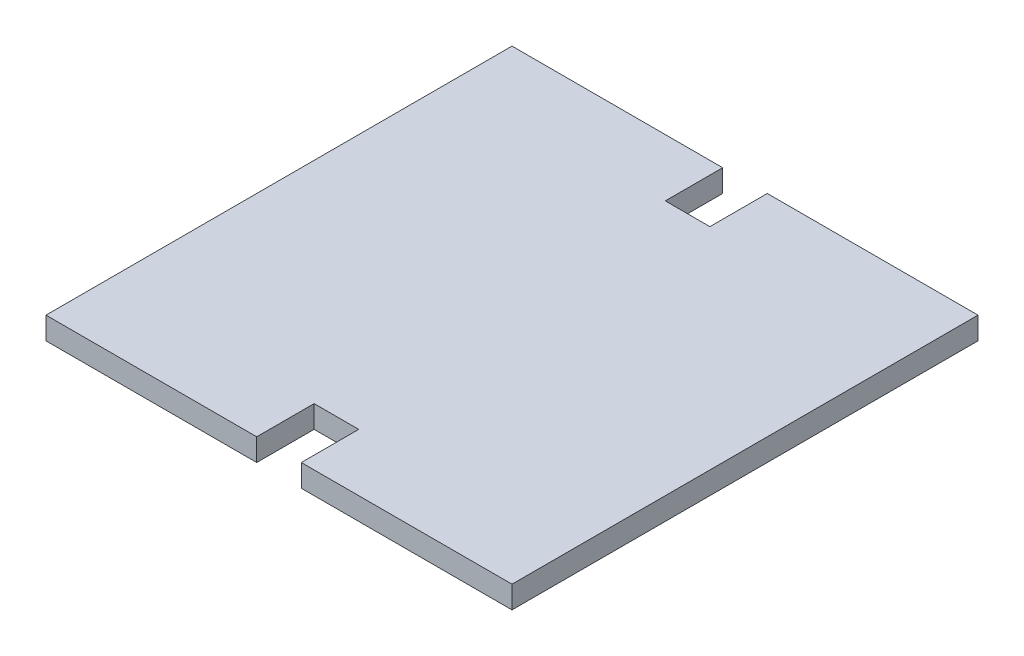
ISO-10303-21;
HEADER;
FILE_DESCRIPTION(('STEP AP214'),'2;1');
FILE_NAME('part.step','',(''),(''),'','','');
FILE_SCHEMA(('AUTOMOTIVE_DESIGN { 1 0 10303 214 1 1 1 1 }'));
ENDSEC;
DATA;
#1=APPLICATION_CONTEXT('core data for automotive mechanical design processes');
#2=APPLICATION_PROTOCOL_DEFINITION('international standard','automotive_design',2000,#1);
#3=PRODUCT_CONTEXT('',#1,'mechanical');
#4=PRODUCT('Part','Part','',(#3));
#5=PRODUCT_RELATED_PRODUCT_CATEGORY('part','',(#4));
#6=PRODUCT_DEFINITION_FORMATION('','',#4);
#7=PRODUCT_DEFINITION_CONTEXT('part definition',#1,'design');
#8=PRODUCT_DEFINITION('design','',#6,#7);
#9=PRODUCT_DEFINITION_SHAPE('','',#8);
#10=(LENGTH_UNIT() NAMED_UNIT(*) SI_UNIT(.MILLI.,.METRE.));
#11=(NAMED_UNIT(*) PLANE_ANGLE_UNIT() SI_UNIT($,.RADIAN.));
#12=(NAMED_UNIT(*) SI_UNIT($,.STERADIAN.) SOLID_ANGLE_UNIT());
#13=UNCERTAINTY_MEASURE_WITH_UNIT(LENGTH_MEASURE(1.E-05),#10,'distance_accuracy_value','');
#14=(GEOMETRIC_REPRESENTATION_CONTEXT(3) GLOBAL_UNCERTAINTY_ASSIGNED_CONTEXT((#13)) GLOBAL_UNIT_ASSIGNED_CONTEXT((#10,
#11,#12)) REPRESENTATION_CONTEXT('',''));
#15=CARTESIAN_POINT('',(0.,0.,0.));
#16=DIRECTION('',(0.,0.,1.));
#17=DIRECTION('',(1.,0.,0.));
#18=AXIS2_PLACEMENT_3D('',#15,#16,#17);
#19=CARTESIAN_POINT('',(-66.35,6.35,66.35));
#20=DIRECTION('',(0.,0.,-1.));
#21=DIRECTION('',(-1.,0.,0.));
#22=AXIS2_PLACEMENT_3D('',#19,#20,#21);
#23=PLANE('',#22);
#24=DIRECTION('',(1.,0.,0.));
#25=VECTOR('',#24,1.);
#26=CARTESIAN_POINT('',(-66.35,6.35,66.35));
#27=LINE('',#26,#25);
#28=CARTESIAN_POINT('',(6.35,6.35,66.35));
#29=VERTEX_POINT('',#28);
#30=CARTESIAN_POINT('',(66.35,6.35,66.35));
#31=VERTEX_POINT('',#30);
#32=EDGE_CURVE('E189',#29,#31,#27,.T.);
#33=ORIENTED_EDGE('',*,*,#32,.F.);
#34=DIRECTION('',(0.,1.,0.));
#35=VECTOR('',#34,1.);
#36=CARTESIAN_POINT('',(6.35,0.,66.35));
#37=LINE('',#36,#35);
#38=CARTESIAN_POINT('',(6.35,0.,66.35));
#39=VERTEX_POINT('',#38);
#40=EDGE_CURVE('E153',#39,#29,#37,.T.);
#41=ORIENTED_EDGE('',*,*,#40,.F.);
#42=DIRECTION('',(1.,0.,0.));
#43=VECTOR('',#42,1.);
#44=CARTESIAN_POINT('',(-66.35,0.,66.35));
#45=LINE('',#44,#43);
#46=CARTESIAN_POINT('',(66.35,0.,66.35));
#47=VERTEX_POINT('',#46);
#48=EDGE_CURVE('E202',#39,#47,#45,.T.);
#49=ORIENTED_EDGE('',*,*,#48,.T.);
#50=DIRECTION('',(0.,-1.,0.));
#51=VECTOR('',#50,1.);
#52=CARTESIAN_POINT('',(66.35,6.35,66.35));
#53=LINE('',#52,#51);
#54=EDGE_CURVE('E193',#31,#47,#53,.T.);
#55=ORIENTED_EDGE('',*,*,#54,.F.);
#56=EDGE_LOOP('',(#33,#41,#49,#55));
#57=FACE_BOUND('',#56,.T.);
#58=ADVANCED_FACE('F32',(#57),#23,.F.);
#59=CARTESIAN_POINT('',(-66.35,6.35,-66.35));
#60=DIRECTION('',(0.,0.,1.));
#61=DIRECTION('',(1.,0.,0.));
#62=AXIS2_PLACEMENT_3D('',#59,#60,#61);
#63=PLANE('',#62);
#64=DIRECTION('',(-1.,0.,0.));
#65=VECTOR('',#64,1.);
#66=CARTESIAN_POINT('',(-66.35,6.35,-66.35));
#67=LINE('',#66,#65);
#68=CARTESIAN_POINT('',(-6.35,6.35,-66.35));
#69=VERTEX_POINT('',#68);
#70=CARTESIAN_POINT('',(-66.35,6.35,-66.35));
#71=VERTEX_POINT('',#70);
#72=EDGE_CURVE('E182',#69,#71,#67,.T.);
#73=ORIENTED_EDGE('',*,*,#72,.F.);
#74=DIRECTION('',(0.,1.,0.));
#75=VECTOR('',#74,1.);
#76=CARTESIAN_POINT('',(-6.35,0.,-66.35));
#77=LINE('',#76,#75);
#78=CARTESIAN_POINT('',(-6.35,0.,-66.35));
#79=VERTEX_POINT('',#78);
#80=EDGE_CURVE('E175',#79,#69,#77,.T.);
#81=ORIENTED_EDGE('',*,*,#80,.F.);
#82=DIRECTION('',(-1.,0.,0.));
#83=VECTOR('',#82,1.);
#84=CARTESIAN_POINT('',(-66.35,0.,-66.35));
#85=LINE('',#84,#83);
#86=CARTESIAN_POINT('',(-66.35,0.,-66.35));
#87=VERTEX_POINT('',#86);
#88=EDGE_CURVE('E196',#79,#87,#85,.T.);
#89=ORIENTED_EDGE('',*,*,#88,.T.);
#90=DIRECTION('',(0.,-1.,0.));
#91=VECTOR('',#90,1.);
#92=CARTESIAN_POINT('',(-66.35,6.35,-66.35));
#93=LINE('',#92,#91);
#94=EDGE_CURVE('E40',#71,#87,#93,.T.);
#95=ORIENTED_EDGE('',*,*,#94,.F.);
#96=EDGE_LOOP('',(#73,#81,#89,#95));
#97=FACE_BOUND('',#96,.T.);
#98=ADVANCED_FACE('F226',(#97),#63,.F.);
#99=CARTESIAN_POINT('',(66.35,6.35,66.35));
#100=DIRECTION('',(-1.,0.,0.));
#101=DIRECTION('',(0.,0.,1.));
#102=AXIS2_PLACEMENT_3D('',#99,#100,#101);
#103=PLANE('',#102);
#104=DIRECTION('',(0.,0.,-1.));
#105=VECTOR('',#104,1.);
#106=CARTESIAN_POINT('',(66.35,0.,66.35));
#107=LINE('',#106,#105);
#108=CARTESIAN_POINT('',(66.35,0.,-66.35));
#109=VERTEX_POINT('',#108);
#110=EDGE_CURVE('E174',#47,#109,#107,.T.);
#111=ORIENTED_EDGE('',*,*,#110,.T.);
#112=DIRECTION('',(0.,-1.,0.));
#113=VECTOR('',#112,1.);
#114=CARTESIAN_POINT('',(66.35,6.35,-66.35));
#115=LINE('',#114,#113);
#116=CARTESIAN_POINT('',(66.35,6.35,-66.35));
#117=VERTEX_POINT('',#116);
#118=EDGE_CURVE('E11',#117,#109,#115,.T.);
#119=ORIENTED_EDGE('',*,*,#118,.F.);
#120=DIRECTION('',(0.,0.,-1.));
#121=VECTOR('',#120,1.);
#122=CARTESIAN_POINT('',(66.35,6.35,66.35));
#123=LINE('',#122,#121);
#124=EDGE_CURVE('E179',#31,#117,#123,.T.);
#125=ORIENTED_EDGE('',*,*,#124,.F.);
#126=ORIENTED_EDGE('',*,*,#54,.T.);
#127=EDGE_LOOP('',(#111,#119,#125,#126));
#128=FACE_BOUND('',#127,.T.);
#129=ADVANCED_FACE('F34',(#128),#103,.F.);
#130=CARTESIAN_POINT('',(6.35000000000001,0.,-66.35));
#131=VERTEX_POINT('',#130);
#132=EDGE_CURVE('E197',#109,#131,#85,.T.);
#133=ORIENTED_EDGE('',*,*,#132,.T.);
#134=DIRECTION('',(0.,1.,0.));
#135=VECTOR('',#134,1.);
#136=CARTESIAN_POINT('',(6.35,0.,-66.35));
#137=LINE('',#136,#135);
#138=CARTESIAN_POINT('',(6.35,6.35,-66.35));
#139=VERTEX_POINT('',#138);
#140=EDGE_CURVE('E55',#131,#139,#137,.T.);
#141=ORIENTED_EDGE('',*,*,#140,.T.);
#142=EDGE_CURVE('E184',#117,#139,#67,.T.);
#143=ORIENTED_EDGE('',*,*,#142,.F.);
#144=ORIENTED_EDGE('',*,*,#118,.T.);
#145=EDGE_LOOP('',(#133,#141,#143,#144));
#146=FACE_BOUND('',#145,.T.);
#147=ADVANCED_FACE('F250',(#146),#63,.F.);
#148=CARTESIAN_POINT('',(-66.35,6.35,66.35));
#149=DIRECTION('',(1.,0.,0.));
#150=DIRECTION('',(0.,0.,-1.));
#151=AXIS2_PLACEMENT_3D('',#148,#149,#150);
#152=PLANE('',#151);
#153=DIRECTION('',(0.,0.,1.));
#154=VECTOR('',#153,1.);
#155=CARTESIAN_POINT('',(-66.35,0.,66.35));
#156=LINE('',#155,#154);
#157=CARTESIAN_POINT('',(-66.35,0.,66.35));
#158=VERTEX_POINT('',#157);
#159=EDGE_CURVE('E200',#87,#158,#156,.T.);
#160=ORIENTED_EDGE('',*,*,#159,.T.);
#161=DIRECTION('',(0.,-1.,0.));
#162=VECTOR('',#161,1.);
#163=CARTESIAN_POINT('',(-66.35,6.35,66.35));
#164=LINE('',#163,#162);
#165=CARTESIAN_POINT('',(-66.35,6.35,66.35));
#166=VERTEX_POINT('',#165);
#167=EDGE_CURVE('E206',#166,#158,#164,.T.);
#168=ORIENTED_EDGE('',*,*,#167,.F.);
#169=DIRECTION('',(0.,0.,1.));
#170=VECTOR('',#169,1.);
#171=CARTESIAN_POINT('',(-66.35,6.35,66.35));
#172=LINE('',#171,#170);
#173=EDGE_CURVE('E187',#71,#166,#172,.T.);
#174=ORIENTED_EDGE('',*,*,#173,.F.);
#175=ORIENTED_EDGE('',*,*,#94,.T.);
#176=EDGE_LOOP('',(#160,#168,#174,#175));
#177=FACE_BOUND('',#176,.T.);
#178=ADVANCED_FACE('F213',(#177),#152,.F.);
#179=CARTESIAN_POINT('',(-6.35,0.,66.35));
#180=VERTEX_POINT('',#179);
#181=EDGE_CURVE('E183',#158,#180,#45,.T.);
#182=ORIENTED_EDGE('',*,*,#181,.T.);
#183=DIRECTION('',(0.,1.,0.));
#184=VECTOR('',#183,1.);
#185=CARTESIAN_POINT('',(-6.35,0.,66.35));
#186=LINE('',#185,#184);
#187=CARTESIAN_POINT('',(-6.35,6.35,66.35));
#188=VERTEX_POINT('',#187);
#189=EDGE_CURVE('E47',#180,#188,#186,.T.);
#190=ORIENTED_EDGE('',*,*,#189,.T.);
#191=EDGE_CURVE('E190',#166,#188,#27,.T.);
#192=ORIENTED_EDGE('',*,*,#191,.F.);
#193=ORIENTED_EDGE('',*,*,#167,.T.);
#194=EDGE_LOOP('',(#182,#190,#192,#193));
#195=FACE_BOUND('',#194,.T.);
#196=ADVANCED_FACE('F219',(#195),#23,.F.);
#197=CARTESIAN_POINT('',(0.,6.35,0.));
#198=DIRECTION('',(0.,-1.,0.));
#199=DIRECTION('',(0.,0.,-1.));
#200=AXIS2_PLACEMENT_3D('',#197,#198,#199);
#201=PLANE('',#200);
#202=DIRECTION('',(-1.,0.,0.));
#203=VECTOR('',#202,1.);
#204=CARTESIAN_POINT('',(6.35,6.35,50.));
#205=LINE('',#204,#203);
#206=CARTESIAN_POINT('',(6.35,6.35,50.));
#207=VERTEX_POINT('',#206);
#208=CARTESIAN_POINT('',(-6.35,6.35,50.));
#209=VERTEX_POINT('',#208);
#210=EDGE_CURVE('E129',#207,#209,#205,.T.);
#211=ORIENTED_EDGE('',*,*,#210,.F.);
#212=DIRECTION('',(0.,0.,-1.));
#213=VECTOR('',#212,1.);
#214=CARTESIAN_POINT('',(6.35,6.35,50.));
#215=LINE('',#214,#213);
#216=EDGE_CURVE('E141',#29,#207,#215,.T.);
#217=ORIENTED_EDGE('',*,*,#216,.F.);
#218=ORIENTED_EDGE('',*,*,#32,.T.);
#219=ORIENTED_EDGE('',*,*,#124,.T.);
#220=ORIENTED_EDGE('',*,*,#142,.T.);
#221=DIRECTION('',(0.,0.,-1.));
#222=VECTOR('',#221,1.);
#223=CARTESIAN_POINT('',(6.35,6.35,-50.));
#224=LINE('',#223,#222);
#225=CARTESIAN_POINT('',(6.35,6.35,-50.));
#226=VERTEX_POINT('',#225);
#227=EDGE_CURVE('E168',#226,#139,#224,.T.);
#228=ORIENTED_EDGE('',*,*,#227,.F.);
#229=DIRECTION('',(1.,0.,0.));
#230=VECTOR('',#229,1.);
#231=CARTESIAN_POINT('',(-6.35,6.35,-50.));
#232=LINE('',#231,#230);
#233=CARTESIAN_POINT('',(-6.35,6.35,-50.));
#234=VERTEX_POINT('',#233);
#235=EDGE_CURVE('E152',#234,#226,#232,.T.);
#236=ORIENTED_EDGE('',*,*,#235,.F.);
#237=DIRECTION('',(0.,0.,1.));
#238=VECTOR('',#237,1.);
#239=CARTESIAN_POINT('',(-6.35,6.35,-50.));
#240=LINE('',#239,#238);
#241=EDGE_CURVE('E160',#69,#234,#240,.T.);
#242=ORIENTED_EDGE('',*,*,#241,.F.);
#243=ORIENTED_EDGE('',*,*,#72,.T.);
#244=ORIENTED_EDGE('',*,*,#173,.T.);
#245=ORIENTED_EDGE('',*,*,#191,.T.);
#246=DIRECTION('',(0.,0.,1.));
#247=VECTOR('',#246,1.);
#248=CARTESIAN_POINT('',(-6.35,6.35,50.));
#249=LINE('',#248,#247);
#250=EDGE_CURVE('E144',#209,#188,#249,.T.);
#251=ORIENTED_EDGE('',*,*,#250,.F.);
#252=EDGE_LOOP('',(#211,#217,#218,#219,#220,#228,#236,#242,#243,#244,#245,#251));
#253=FACE_BOUND('',#252,.T.);
#254=ADVANCED_FACE('F222',(#253),#201,.F.);
#255=CARTESIAN_POINT('',(0.,0.,0.));
#256=DIRECTION('',(0.,-1.,0.));
#257=DIRECTION('',(0.,0.,-1.));
#258=AXIS2_PLACEMENT_3D('',#255,#256,#257);
#259=PLANE('',#258);
#260=DIRECTION('',(0.,0.,-1.));
#261=VECTOR('',#260,1.);
#262=CARTESIAN_POINT('',(6.35,0.,50.));
#263=LINE('',#262,#261);
#264=CARTESIAN_POINT('',(6.35,0.,50.));
#265=VERTEX_POINT('',#264);
#266=EDGE_CURVE('E131',#39,#265,#263,.T.);
#267=ORIENTED_EDGE('',*,*,#266,.T.);
#268=DIRECTION('',(-1.,0.,0.));
#269=VECTOR('',#268,1.);
#270=CARTESIAN_POINT('',(6.35,0.,50.));
#271=LINE('',#270,#269);
#272=CARTESIAN_POINT('',(-6.35,0.,50.));
#273=VERTEX_POINT('',#272);
#274=EDGE_CURVE('E126',#265,#273,#271,.T.);
#275=ORIENTED_EDGE('',*,*,#274,.T.);
#276=DIRECTION('',(0.,0.,1.));
#277=VECTOR('',#276,1.);
#278=CARTESIAN_POINT('',(-6.35,0.,50.));
#279=LINE('',#278,#277);
#280=EDGE_CURVE('E133',#273,#180,#279,.T.);
#281=ORIENTED_EDGE('',*,*,#280,.T.);
#282=ORIENTED_EDGE('',*,*,#181,.F.);
#283=ORIENTED_EDGE('',*,*,#159,.F.);
#284=ORIENTED_EDGE('',*,*,#88,.F.);
#285=DIRECTION('',(0.,0.,1.));
#286=VECTOR('',#285,1.);
#287=CARTESIAN_POINT('',(-6.35,0.,-50.));
#288=LINE('',#287,#286);
#289=CARTESIAN_POINT('',(-6.35,0.,-50.));
#290=VERTEX_POINT('',#289);
#291=EDGE_CURVE('E162',#79,#290,#288,.T.);
#292=ORIENTED_EDGE('',*,*,#291,.T.);
#293=DIRECTION('',(1.,0.,0.));
#294=VECTOR('',#293,1.);
#295=CARTESIAN_POINT('',(-6.35,0.,-50.));
#296=LINE('',#295,#294);
#297=CARTESIAN_POINT('',(6.35,0.,-50.));
#298=VERTEX_POINT('',#297);
#299=EDGE_CURVE('E156',#290,#298,#296,.T.);
#300=ORIENTED_EDGE('',*,*,#299,.T.);
#301=DIRECTION('',(0.,0.,-1.));
#302=VECTOR('',#301,1.);
#303=CARTESIAN_POINT('',(6.35,0.,-50.));
#304=LINE('',#303,#302);
#305=EDGE_CURVE('E159',#298,#131,#304,.T.);
#306=ORIENTED_EDGE('',*,*,#305,.T.);
#307=ORIENTED_EDGE('',*,*,#132,.F.);
#308=ORIENTED_EDGE('',*,*,#110,.F.);
#309=ORIENTED_EDGE('',*,*,#48,.F.);
#310=EDGE_LOOP('',(#267,#275,#281,#282,#283,#284,#292,#300,#306,#307,#308,#309));
#311=FACE_BOUND('',#310,.T.);
#312=ADVANCED_FACE('F139',(#311),#259,.T.);
#313=CARTESIAN_POINT('',(-6.35,0.,-50.));
#314=DIRECTION('',(0.,0.,1.));
#315=DIRECTION('',(1.,0.,0.));
#316=AXIS2_PLACEMENT_3D('',#313,#314,#315);
#317=PLANE('',#316);
#318=ORIENTED_EDGE('',*,*,#235,.T.);
#319=DIRECTION('',(0.,1.,0.));
#320=VECTOR('',#319,1.);
#321=CARTESIAN_POINT('',(6.35,0.,-50.));
#322=LINE('',#321,#320);
#323=EDGE_CURVE('E165',#298,#226,#322,.T.);
#324=ORIENTED_EDGE('',*,*,#323,.F.);
#325=ORIENTED_EDGE('',*,*,#299,.F.);
#326=DIRECTION('',(0.,1.,0.));
#327=VECTOR('',#326,1.);
#328=CARTESIAN_POINT('',(-6.35,0.,-50.));
#329=LINE('',#328,#327);
#330=EDGE_CURVE('E172',#290,#234,#329,.T.);
#331=ORIENTED_EDGE('',*,*,#330,.T.);
#332=EDGE_LOOP('',(#318,#324,#325,#331));
#333=FACE_BOUND('',#332,.T.);
#334=ADVANCED_FACE('F231',(#333),#317,.F.);
#335=CARTESIAN_POINT('',(-6.35,0.,-50.));
#336=DIRECTION('',(-1.,0.,0.));
#337=DIRECTION('',(0.,0.,1.));
#338=AXIS2_PLACEMENT_3D('',#335,#336,#337);
#339=PLANE('',#338);
#340=ORIENTED_EDGE('',*,*,#241,.T.);
#341=ORIENTED_EDGE('',*,*,#330,.F.);
#342=ORIENTED_EDGE('',*,*,#291,.F.);
#343=ORIENTED_EDGE('',*,*,#80,.T.);
#344=EDGE_LOOP('',(#340,#341,#342,#343));
#345=FACE_BOUND('',#344,.T.);
#346=ADVANCED_FACE('F228',(#345),#339,.F.);
#347=CARTESIAN_POINT('',(6.35,0.,-50.));
#348=DIRECTION('',(1.,0.,0.));
#349=DIRECTION('',(0.,0.,-1.));
#350=AXIS2_PLACEMENT_3D('',#347,#348,#349);
#351=PLANE('',#350);
#352=ORIENTED_EDGE('',*,*,#227,.T.);
#353=ORIENTED_EDGE('',*,*,#140,.F.);
#354=ORIENTED_EDGE('',*,*,#305,.F.);
#355=ORIENTED_EDGE('',*,*,#323,.T.);
#356=EDGE_LOOP('',(#352,#353,#354,#355));
#357=FACE_BOUND('',#356,.T.);
#358=ADVANCED_FACE('F233',(#357),#351,.F.);
#359=CARTESIAN_POINT('',(6.35,0.,50.));
#360=DIRECTION('',(0.,0.,-1.));
#361=DIRECTION('',(-1.,0.,0.));
#362=AXIS2_PLACEMENT_3D('',#359,#360,#361);
#363=PLANE('',#362);
#364=ORIENTED_EDGE('',*,*,#210,.T.);
#365=DIRECTION('',(0.,1.,0.));
#366=VECTOR('',#365,1.);
#367=CARTESIAN_POINT('',(-6.35,0.,50.));
#368=LINE('',#367,#366);
#369=EDGE_CURVE('E123',#273,#209,#368,.T.);
#370=ORIENTED_EDGE('',*,*,#369,.F.);
#371=ORIENTED_EDGE('',*,*,#274,.F.);
#372=DIRECTION('',(0.,1.,0.));
#373=VECTOR('',#372,1.);
#374=CARTESIAN_POINT('',(6.35,0.,50.));
#375=LINE('',#374,#373);
#376=EDGE_CURVE('E150',#265,#207,#375,.T.);
#377=ORIENTED_EDGE('',*,*,#376,.T.);
#378=EDGE_LOOP('',(#364,#370,#371,#377));
#379=FACE_BOUND('',#378,.T.);
#380=ADVANCED_FACE('F124',(#379),#363,.F.);
#381=CARTESIAN_POINT('',(6.35,0.,50.));
#382=DIRECTION('',(1.,0.,0.));
#383=DIRECTION('',(0.,0.,-1.));
#384=AXIS2_PLACEMENT_3D('',#381,#382,#383);
#385=PLANE('',#384);
#386=ORIENTED_EDGE('',*,*,#216,.T.);
#387=ORIENTED_EDGE('',*,*,#376,.F.);
#388=ORIENTED_EDGE('',*,*,#266,.F.);
#389=ORIENTED_EDGE('',*,*,#40,.T.);
#390=EDGE_LOOP('',(#386,#387,#388,#389));
#391=FACE_BOUND('',#390,.T.);
#392=ADVANCED_FACE('F240',(#391),#385,.F.);
#393=CARTESIAN_POINT('',(-6.35,0.,50.));
#394=DIRECTION('',(-1.,0.,0.));
#395=DIRECTION('',(0.,0.,1.));
#396=AXIS2_PLACEMENT_3D('',#393,#394,#395);
#397=PLANE('',#396);
#398=ORIENTED_EDGE('',*,*,#250,.T.);
#399=ORIENTED_EDGE('',*,*,#189,.F.);
#400=ORIENTED_EDGE('',*,*,#280,.F.);
#401=ORIENTED_EDGE('',*,*,#369,.T.);
#402=EDGE_LOOP('',(#398,#399,#400,#401));
#403=FACE_BOUND('',#402,.T.);
#404=ADVANCED_FACE('F134',(#403),#397,.F.);
#405=CLOSED_SHELL('',(#58,#98,#129,#147,#178,#196,#254,#312,#334,#346,#358,#380,#392,#404));
#406=MANIFOLD_SOLID_BREP('B2',#405);
#407=ADVANCED_BREP_SHAPE_REPRESENTATION('',(#18,#406),#14);
#408=SHAPE_DEFINITION_REPRESENTATION(#9,#407);
ENDSEC;
END-ISO-10303-21;
